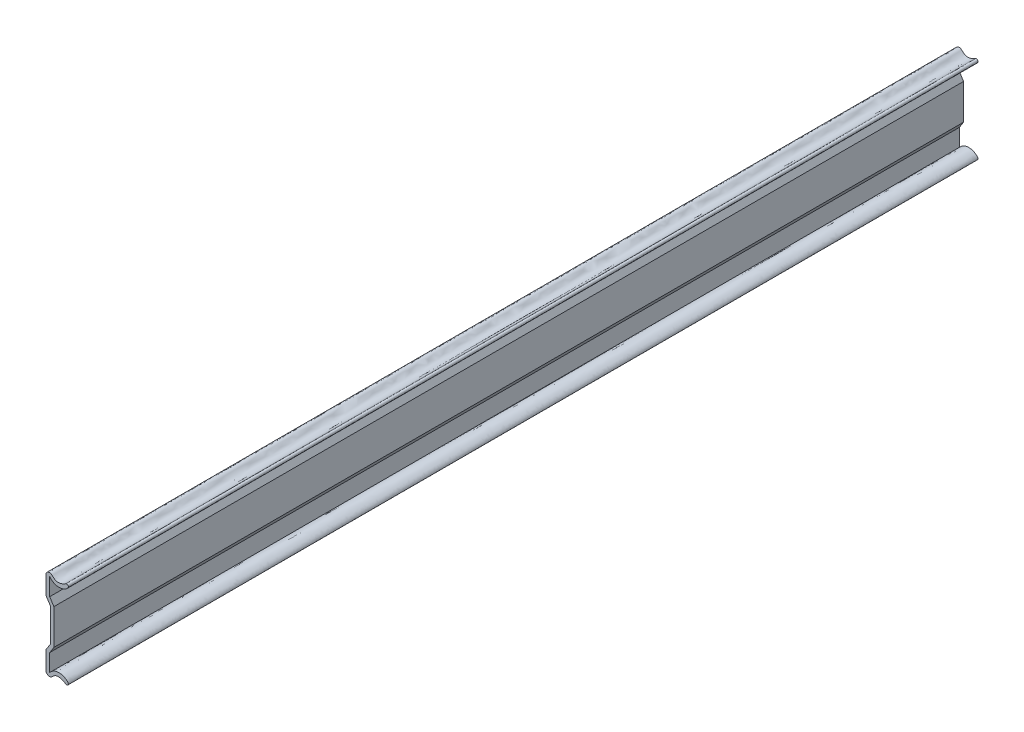
ISO-10303-21;
HEADER;
FILE_DESCRIPTION(('STEP AP214'),'2;1');
FILE_NAME('part.step','',(''),(''),'','','');
FILE_SCHEMA(('AUTOMOTIVE_DESIGN { 1 0 10303 214 1 1 1 1 }'));
ENDSEC;
DATA;
#1=APPLICATION_CONTEXT('core data for automotive mechanical design processes');
#2=APPLICATION_PROTOCOL_DEFINITION('international standard','automotive_design',2000,#1);
#3=PRODUCT_CONTEXT('',#1,'mechanical');
#4=PRODUCT('Part','Part','',(#3));
#5=PRODUCT_RELATED_PRODUCT_CATEGORY('part','',(#4));
#6=PRODUCT_DEFINITION_FORMATION('','',#4);
#7=PRODUCT_DEFINITION_CONTEXT('part definition',#1,'design');
#8=PRODUCT_DEFINITION('design','',#6,#7);
#9=PRODUCT_DEFINITION_SHAPE('','',#8);
#10=(LENGTH_UNIT() NAMED_UNIT(*) SI_UNIT(.MILLI.,.METRE.));
#11=(NAMED_UNIT(*) PLANE_ANGLE_UNIT() SI_UNIT($,.RADIAN.));
#12=(NAMED_UNIT(*) SI_UNIT($,.STERADIAN.) SOLID_ANGLE_UNIT());
#13=UNCERTAINTY_MEASURE_WITH_UNIT(LENGTH_MEASURE(1.E-05),#10,'distance_accuracy_value','');
#14=(GEOMETRIC_REPRESENTATION_CONTEXT(3) GLOBAL_UNCERTAINTY_ASSIGNED_CONTEXT((#13)) GLOBAL_UNIT_ASSIGNED_CONTEXT((#10,
#11,#12)) REPRESENTATION_CONTEXT('',''));
#15=CARTESIAN_POINT('',(0.,0.,0.));
#16=DIRECTION('',(0.,0.,1.));
#17=DIRECTION('',(1.,0.,0.));
#18=AXIS2_PLACEMENT_3D('',#15,#16,#17);
#19=CARTESIAN_POINT('',(9.63346315925961,3919.9605408872,346.));
#20=CARTESIAN_POINT('',(10.4179465492456,3919.37665859407,346.));
#21=CARTESIAN_POINT('',(11.5676687046074,3920.45353455855,346.));
#22=CARTESIAN_POINT('',(9.78538349795511,3921.55514871065,346.));
#23=CARTESIAN_POINT('',(9.77859557084661,3921.55932008849,346.));
#24=CARTESIAN_POINT('',(9.0247952971132,3922.02177137892,346.));
#25=CARTESIAN_POINT('',(8.45326854344088,3922.25080486334,346.));
#26=CARTESIAN_POINT('',(7.53015044228269,3922.35437653868,346.));
#27=CARTESIAN_POINT('',(7.25037518805879,3922.36057796796,346.));
#28=CARTESIAN_POINT('',(6.01569333351951,3922.29069846277,346.));
#29=CARTESIAN_POINT('',(4.86014170825701,3921.98158674794,346.));
#30=CARTESIAN_POINT('',(3.66140402910439,3920.61295155468,346.));
#31=B_SPLINE_CURVE_WITH_KNOTS('',3,(#19,#20,#21,#22,#23,#24,#25,#26,#27,#28,#29,#30),
.UNSPECIFIED.,.F.,.F.,(4,2,2,2,2,4),(0.,0.188476562502227,0.188964843752215,0.500000000001334,
0.625000000001001,1.),.UNSPECIFIED.);
#32=DIRECTION('',(0.,0.,-1.));
#33=VECTOR('',#32,1.);
#34=SURFACE_OF_LINEAR_EXTRUSION('',#31,#33);
#35=CARTESIAN_POINT('',(9.63346315925961,3919.9605408872,0.));
#36=CARTESIAN_POINT('',(10.4179465492456,3919.37665859407,0.));
#37=CARTESIAN_POINT('',(11.5676687046074,3920.45353455855,0.));
#38=CARTESIAN_POINT('',(9.78538349795511,3921.55514871065,0.));
#39=CARTESIAN_POINT('',(9.77859557084661,3921.55932008849,0.));
#40=CARTESIAN_POINT('',(9.0247952971132,3922.02177137892,0.));
#41=CARTESIAN_POINT('',(8.45326854344088,3922.25080486334,0.));
#42=CARTESIAN_POINT('',(7.53015044228269,3922.35437653868,0.));
#43=CARTESIAN_POINT('',(7.25037518805879,3922.36057796796,0.));
#44=CARTESIAN_POINT('',(6.01569333351951,3922.29069846277,0.));
#45=CARTESIAN_POINT('',(4.86014170825701,3921.98158674794,0.));
#46=CARTESIAN_POINT('',(3.66140402910439,3920.61295155468,0.));
#47=B_SPLINE_CURVE_WITH_KNOTS('',3,(#35,#36,#37,#38,#39,#40,#41,#42,#43,#44,#45,#46),
.UNSPECIFIED.,.F.,.F.,(4,2,2,2,2,4),(0.,0.188476562502227,0.188964843752215,0.500000000001334,
0.625000000001001,1.),.UNSPECIFIED.);
#48=CARTESIAN_POINT('',(9.63346315925961,3919.9605408872,0.));
#49=VERTEX_POINT('',#48);
#50=CARTESIAN_POINT('',(3.66140402910439,3920.61295155468,0.));
#51=VERTEX_POINT('',#50);
#52=EDGE_CURVE('E165',#49,#51,#47,.T.);
#53=ORIENTED_EDGE('',*,*,#52,.T.);
#54=DIRECTION('',(0.,0.,-1.));
#55=VECTOR('',#54,1.);
#56=CARTESIAN_POINT('',(3.66140402910439,3920.61295155468,346.));
#57=LINE('',#56,#55);
#58=CARTESIAN_POINT('',(3.66140402910439,3920.61295155468,346.));
#59=VERTEX_POINT('',#58);
#60=EDGE_CURVE('E11',#59,#51,#57,.T.);
#61=ORIENTED_EDGE('',*,*,#60,.F.);
#62=CARTESIAN_POINT('',(9.63346315925961,3919.9605408872,346.));
#63=VERTEX_POINT('',#62);
#64=EDGE_CURVE('E218',#63,#59,#31,.T.);
#65=ORIENTED_EDGE('',*,*,#64,.F.);
#66=DIRECTION('',(0.,0.,-1.));
#67=VECTOR('',#66,1.);
#68=CARTESIAN_POINT('',(9.63346315925961,3919.9605408872,346.));
#69=LINE('',#68,#67);
#70=EDGE_CURVE('E158',#63,#49,#69,.T.);
#71=ORIENTED_EDGE('',*,*,#70,.T.);
#72=EDGE_LOOP('',(#53,#61,#65,#71));
#73=FACE_BOUND('',#72,.T.);
#74=ADVANCED_FACE('F41',(#73),#34,.F.);
#75=CARTESIAN_POINT('',(3.6614040291,3927.2014944656,346.));
#76=DIRECTION('',(-1.,-6.66396982923268E-13,0.));
#77=DIRECTION('',(6.66396982923268E-13,-1.,0.));
#78=AXIS2_PLACEMENT_3D('',#75,#76,#77);
#79=PLANE('',#78);
#80=DIRECTION('',(-6.66396982923268E-13,1.,0.));
#81=VECTOR('',#80,1.);
#82=CARTESIAN_POINT('',(3.6614040291,3927.2014944656,0.));
#83=LINE('',#82,#81);
#84=CARTESIAN_POINT('',(3.6614040291,3927.2014944656,0.));
#85=VERTEX_POINT('',#84);
#86=EDGE_CURVE('E266',#51,#85,#83,.T.);
#87=ORIENTED_EDGE('',*,*,#86,.T.);
#88=DIRECTION('',(0.,0.,-1.));
#89=VECTOR('',#88,1.);
#90=CARTESIAN_POINT('',(3.6614040291,3927.2014944656,346.));
#91=LINE('',#90,#89);
#92=CARTESIAN_POINT('',(3.6614040291,3927.2014944656,346.));
#93=VERTEX_POINT('',#92);
#94=EDGE_CURVE('E50',#93,#85,#91,.T.);
#95=ORIENTED_EDGE('',*,*,#94,.F.);
#96=DIRECTION('',(-6.66396982923268E-13,1.,0.));
#97=VECTOR('',#96,1.);
#98=CARTESIAN_POINT('',(3.6614040291,3927.2014944656,346.));
#99=LINE('',#98,#97);
#100=EDGE_CURVE('E113',#59,#93,#99,.T.);
#101=ORIENTED_EDGE('',*,*,#100,.F.);
#102=ORIENTED_EDGE('',*,*,#60,.T.);
#103=EDGE_LOOP('',(#87,#95,#101,#102));
#104=FACE_BOUND('',#103,.T.);
#105=ADVANCED_FACE('F296',(#104),#79,.F.);
#106=CARTESIAN_POINT('',(5.2393246095,3929.6888032793,346.));
#107=DIRECTION('',(-0.844416011919757,0.535687967769982,0.));
#108=DIRECTION('',(-0.535687967769982,-0.844416011919757,0.));
#109=AXIS2_PLACEMENT_3D('',#106,#107,#108);
#110=PLANE('',#109);
#111=DIRECTION('',(0.535687967769982,0.844416011919757,0.));
#112=VECTOR('',#111,1.);
#113=CARTESIAN_POINT('',(5.2393246095,3929.6888032793,0.));
#114=LINE('',#113,#112);
#115=CARTESIAN_POINT('',(5.2393246095,3929.6888032793,0.));
#116=VERTEX_POINT('',#115);
#117=EDGE_CURVE('E262',#85,#116,#114,.T.);
#118=ORIENTED_EDGE('',*,*,#117,.T.);
#119=DIRECTION('',(0.,0.,-1.));
#120=VECTOR('',#119,1.);
#121=CARTESIAN_POINT('',(5.2393246095,3929.6888032793,346.));
#122=LINE('',#121,#120);
#123=CARTESIAN_POINT('',(5.2393246095,3929.6888032793,346.));
#124=VERTEX_POINT('',#123);
#125=EDGE_CURVE('E254',#124,#116,#122,.T.);
#126=ORIENTED_EDGE('',*,*,#125,.F.);
#127=DIRECTION('',(0.535687967769982,0.844416011919757,0.));
#128=VECTOR('',#127,1.);
#129=CARTESIAN_POINT('',(5.2393246095,3929.6888032793,346.));
#130=LINE('',#129,#128);
#131=EDGE_CURVE('E216',#93,#124,#130,.T.);
#132=ORIENTED_EDGE('',*,*,#131,.F.);
#133=ORIENTED_EDGE('',*,*,#94,.T.);
#134=EDGE_LOOP('',(#118,#126,#132,#133));
#135=FACE_BOUND('',#134,.T.);
#136=ADVANCED_FACE('F260',(#135),#110,.F.);
#137=CARTESIAN_POINT('',(5.2393246095,3943.1194255212,346.));
#138=DIRECTION('',(-1.,0.,0.));
#139=DIRECTION('',(0.,0.,1.));
#140=AXIS2_PLACEMENT_3D('',#137,#138,#139);
#141=PLANE('',#140);
#142=DIRECTION('',(0.,1.,0.));
#143=VECTOR('',#142,1.);
#144=CARTESIAN_POINT('',(5.2393246095,3943.1194255212,0.));
#145=LINE('',#144,#143);
#146=CARTESIAN_POINT('',(5.2393246095,3943.1194255212,0.));
#147=VERTEX_POINT('',#146);
#148=EDGE_CURVE('E268',#116,#147,#145,.T.);
#149=ORIENTED_EDGE('',*,*,#148,.T.);
#150=DIRECTION('',(0.,0.,-1.));
#151=VECTOR('',#150,1.);
#152=CARTESIAN_POINT('',(5.2393246095,3943.1194255212,346.));
#153=LINE('',#152,#151);
#154=CARTESIAN_POINT('',(5.2393246095,3943.1194255212,346.));
#155=VERTEX_POINT('',#154);
#156=EDGE_CURVE('E251',#155,#147,#153,.T.);
#157=ORIENTED_EDGE('',*,*,#156,.F.);
#158=DIRECTION('',(0.,1.,0.));
#159=VECTOR('',#158,1.);
#160=CARTESIAN_POINT('',(5.2393246095,3943.1194255212,346.));
#161=LINE('',#160,#159);
#162=EDGE_CURVE('E214',#124,#155,#161,.T.);
#163=ORIENTED_EDGE('',*,*,#162,.F.);
#164=ORIENTED_EDGE('',*,*,#125,.T.);
#165=EDGE_LOOP('',(#149,#157,#163,#164));
#166=FACE_BOUND('',#165,.T.);
#167=ADVANCED_FACE('F302',(#166),#141,.F.);
#168=CARTESIAN_POINT('',(3.6614040291,3945.6067343349,346.));
#169=DIRECTION('',(-0.844416011919757,-0.535687967769982,0.));
#170=DIRECTION('',(0.535687967769982,-0.844416011919757,0.));
#171=AXIS2_PLACEMENT_3D('',#168,#169,#170);
#172=PLANE('',#171);
#173=DIRECTION('',(-0.535687967769982,0.844416011919757,0.));
#174=VECTOR('',#173,1.);
#175=CARTESIAN_POINT('',(3.6614040291,3945.6067343349,0.));
#176=LINE('',#175,#174);
#177=CARTESIAN_POINT('',(3.6614040291,3945.6067343349,0.));
#178=VERTEX_POINT('',#177);
#179=EDGE_CURVE('E270',#147,#178,#176,.T.);
#180=ORIENTED_EDGE('',*,*,#179,.T.);
#181=DIRECTION('',(0.,0.,-1.));
#182=VECTOR('',#181,1.);
#183=CARTESIAN_POINT('',(3.6614040291,3945.6067343349,346.));
#184=LINE('',#183,#182);
#185=CARTESIAN_POINT('',(3.6614040291,3945.6067343349,346.));
#186=VERTEX_POINT('',#185);
#187=EDGE_CURVE('E248',#186,#178,#184,.T.);
#188=ORIENTED_EDGE('',*,*,#187,.F.);
#189=DIRECTION('',(-0.535687967769982,0.844416011919757,0.));
#190=VECTOR('',#189,1.);
#191=CARTESIAN_POINT('',(3.6614040291,3945.6067343349,346.));
#192=LINE('',#191,#190);
#193=EDGE_CURVE('E212',#155,#186,#192,.T.);
#194=ORIENTED_EDGE('',*,*,#193,.F.);
#195=ORIENTED_EDGE('',*,*,#156,.T.);
#196=EDGE_LOOP('',(#180,#188,#194,#195));
#197=FACE_BOUND('',#196,.T.);
#198=ADVANCED_FACE('F307',(#197),#172,.F.);
#199=CARTESIAN_POINT('',(3.66140402910439,3952.19527724581,346.));
#200=DIRECTION('',(-1.,6.66133688976044E-13,0.));
#201=DIRECTION('',(-6.66133688976044E-13,-1.,0.));
#202=AXIS2_PLACEMENT_3D('',#199,#200,#201);
#203=PLANE('',#202);
#204=DIRECTION('',(6.66133688976044E-13,1.,0.));
#205=VECTOR('',#204,1.);
#206=CARTESIAN_POINT('',(3.66140402910439,3952.19527724581,0.));
#207=LINE('',#206,#205);
#208=CARTESIAN_POINT('',(3.66140402910439,3952.19527724581,0.));
#209=VERTEX_POINT('',#208);
#210=EDGE_CURVE('E274',#178,#209,#207,.T.);
#211=ORIENTED_EDGE('',*,*,#210,.T.);
#212=DIRECTION('',(0.,0.,-1.));
#213=VECTOR('',#212,1.);
#214=CARTESIAN_POINT('',(3.66140402910439,3952.19527724581,346.));
#215=LINE('',#214,#213);
#216=CARTESIAN_POINT('',(3.66140402910439,3952.19527724581,346.));
#217=VERTEX_POINT('',#216);
#218=EDGE_CURVE('E245',#217,#209,#215,.T.);
#219=ORIENTED_EDGE('',*,*,#218,.F.);
#220=DIRECTION('',(6.66133688976044E-13,1.,0.));
#221=VECTOR('',#220,1.);
#222=CARTESIAN_POINT('',(3.66140402910439,3952.19527724581,346.));
#223=LINE('',#222,#221);
#224=EDGE_CURVE('E207',#186,#217,#223,.T.);
#225=ORIENTED_EDGE('',*,*,#224,.F.);
#226=ORIENTED_EDGE('',*,*,#187,.T.);
#227=EDGE_LOOP('',(#211,#219,#225,#226));
#228=FACE_BOUND('',#227,.T.);
#229=ADVANCED_FACE('F310',(#228),#203,.F.);
#230=CARTESIAN_POINT('',(3.66140402910439,3952.19527724581,346.));
#231=CARTESIAN_POINT('',(4.86014170825695,3950.82664205255,346.));
#232=CARTESIAN_POINT('',(6.0156933335194,3950.51753033771,346.));
#233=CARTESIAN_POINT('',(7.25037518805879,3950.44765083253,346.));
#234=CARTESIAN_POINT('',(7.5301504422827,3950.45385226181,346.));
#235=CARTESIAN_POINT('',(8.45326854344119,3950.55742393714,346.));
#236=CARTESIAN_POINT('',(9.02479529713174,3950.78645742166,346.));
#237=CARTESIAN_POINT('',(9.7785955708466,3951.248908712,346.));
#238=CARTESIAN_POINT('',(9.78538349795494,3951.25308008984,346.));
#239=CARTESIAN_POINT('',(11.5676687046076,3952.35469424233,346.));
#240=CARTESIAN_POINT('',(10.4179465492456,3953.43157020642,346.));
#241=CARTESIAN_POINT('',(9.63346315925961,3952.84768791328,346.));
#242=B_SPLINE_CURVE_WITH_KNOTS('',3,(#230,#231,#232,#233,#234,#235,#236,#237,#238,#239,#240,
#241),.UNSPECIFIED.,.F.,.F.,(4,2,2,2,2,4),(0.,0.374999999997284,0.499999999996364,
0.811035156244175,0.811523437494173,1.),.UNSPECIFIED.);
#243=DIRECTION('',(0.,0.,-1.));
#244=VECTOR('',#243,1.);
#245=SURFACE_OF_LINEAR_EXTRUSION('',#242,#244);
#246=CARTESIAN_POINT('',(3.66140402910439,3952.19527724581,0.));
#247=CARTESIAN_POINT('',(4.86014170825695,3950.82664205255,0.));
#248=CARTESIAN_POINT('',(6.0156933335194,3950.51753033771,0.));
#249=CARTESIAN_POINT('',(7.25037518805879,3950.44765083253,0.));
#250=CARTESIAN_POINT('',(7.5301504422827,3950.45385226181,0.));
#251=CARTESIAN_POINT('',(8.45326854344119,3950.55742393714,0.));
#252=CARTESIAN_POINT('',(9.02479529713174,3950.78645742166,0.));
#253=CARTESIAN_POINT('',(9.7785955708466,3951.248908712,0.));
#254=CARTESIAN_POINT('',(9.78538349795494,3951.25308008984,0.));
#255=CARTESIAN_POINT('',(11.5676687046076,3952.35469424233,0.));
#256=CARTESIAN_POINT('',(10.4179465492456,3953.43157020642,0.));
#257=CARTESIAN_POINT('',(9.63346315925961,3952.84768791328,0.));
#258=B_SPLINE_CURVE_WITH_KNOTS('',3,(#246,#247,#248,#249,#250,#251,#252,#253,#254,#255,#256,
#257),.UNSPECIFIED.,.F.,.F.,(4,2,2,2,2,4),(0.,0.374999999997284,0.499999999996364,
0.811035156244175,0.811523437494173,1.),.UNSPECIFIED.);
#259=CARTESIAN_POINT('',(9.63346315925961,3952.84768791328,0.));
#260=VERTEX_POINT('',#259);
#261=EDGE_CURVE('E276',#209,#260,#258,.T.);
#262=ORIENTED_EDGE('',*,*,#261,.T.);
#263=DIRECTION('',(0.,0.,-1.));
#264=VECTOR('',#263,1.);
#265=CARTESIAN_POINT('',(9.63346315925961,3952.84768791328,346.));
#266=LINE('',#265,#264);
#267=CARTESIAN_POINT('',(9.63346315925961,3952.84768791328,346.));
#268=VERTEX_POINT('',#267);
#269=EDGE_CURVE('E242',#268,#260,#266,.T.);
#270=ORIENTED_EDGE('',*,*,#269,.F.);
#271=EDGE_CURVE('E199',#217,#268,#242,.T.);
#272=ORIENTED_EDGE('',*,*,#271,.F.);
#273=ORIENTED_EDGE('',*,*,#218,.T.);
#274=EDGE_LOOP('',(#262,#270,#272,#273));
#275=FACE_BOUND('',#274,.T.);
#276=ADVANCED_FACE('F191',(#275),#245,.F.);
#277=CARTESIAN_POINT('',(9.63346315925961,3952.84768791328,346.));
#278=CARTESIAN_POINT('',(9.27087462847787,3952.57781728821,346.));
#279=CARTESIAN_POINT('',(8.71617917900728,3952.30704735755,346.));
#280=CARTESIAN_POINT('',(7.87069384825325,3952.03851033674,346.));
#281=CARTESIAN_POINT('',(7.58807969295691,3951.97297140786,346.));
#282=CARTESIAN_POINT('',(6.79128584631731,3951.87212702572,346.));
#283=CARTESIAN_POINT('',(6.31651759251921,3951.92429718608,346.));
#284=CARTESIAN_POINT('',(5.72807196973788,3952.15260886724,346.));
#285=CARTESIAN_POINT('',(5.55433883904812,3952.25573905537,346.));
#286=CARTESIAN_POINT('',(5.08318774191439,3952.60869439284,346.));
#287=CARTESIAN_POINT('',(4.58125792989248,3953.18740668712,346.));
#288=CARTESIAN_POINT('',(4.04776020516461,3953.4692331204,346.));
#289=CARTESIAN_POINT('',(3.62159338363642,3953.52389077551,346.));
#290=CARTESIAN_POINT('',(3.47409011930244,3953.51491002304,346.));
#291=CARTESIAN_POINT('',(2.9857451967978,3953.39733177624,346.));
#292=CARTESIAN_POINT('',(2.64491347210658,3953.18919369859,346.));
#293=CARTESIAN_POINT('',(2.43733029743488,3952.95399387343,346.));
#294=CARTESIAN_POINT('',(2.41853461286513,3952.93130014485,346.));
#295=CARTESIAN_POINT('',(2.23236408080449,3952.64476797959,346.));
#296=CARTESIAN_POINT('',(2.24716153988511,3952.00532021402,346.));
#297=CARTESIAN_POINT('',(2.24716153988511,3945.28354046304,346.));
#298=B_SPLINE_CURVE_WITH_KNOTS('',3,(#277,#278,#279,#280,#281,#282,#283,#284,#285,#286,#287,
#288,#289,#290,#291,#292,#293,#294,#295,#296,#297),.UNSPECIFIED.,.F.,.F.,(4,2,2,2,2,1,2,2,2,2,
4),(0.,0.125000000000089,0.187500000000133,0.312500000000222,0.375000000000266,0.50000000000027,
0.625000000000274,0.687500000000263,0.828125000000239,0.843750000000237,1.),.UNSPECIFIED.);
#299=DIRECTION('',(0.,0.,-1.));
#300=VECTOR('',#299,1.);
#301=SURFACE_OF_LINEAR_EXTRUSION('',#298,#300);
#302=CARTESIAN_POINT('',(9.63346315925961,3952.84768791328,0.));
#303=CARTESIAN_POINT('',(9.27087462847787,3952.57781728821,0.));
#304=CARTESIAN_POINT('',(8.71617917900728,3952.30704735755,0.));
#305=CARTESIAN_POINT('',(7.87069384825325,3952.03851033674,0.));
#306=CARTESIAN_POINT('',(7.58807969295691,3951.97297140786,0.));
#307=CARTESIAN_POINT('',(6.79128584631731,3951.87212702572,0.));
#308=CARTESIAN_POINT('',(6.31651759251921,3951.92429718608,0.));
#309=CARTESIAN_POINT('',(5.72807196973788,3952.15260886724,0.));
#310=CARTESIAN_POINT('',(5.55433883904812,3952.25573905537,0.));
#311=CARTESIAN_POINT('',(5.08318774191439,3952.60869439284,0.));
#312=CARTESIAN_POINT('',(4.58125792989248,3953.18740668712,0.));
#313=CARTESIAN_POINT('',(4.04776020516461,3953.4692331204,0.));
#314=CARTESIAN_POINT('',(3.62159338363642,3953.52389077551,0.));
#315=CARTESIAN_POINT('',(3.47409011930244,3953.51491002304,0.));
#316=CARTESIAN_POINT('',(2.9857451967978,3953.39733177624,0.));
#317=CARTESIAN_POINT('',(2.64491347210658,3953.18919369859,0.));
#318=CARTESIAN_POINT('',(2.43733029743488,3952.95399387343,0.));
#319=CARTESIAN_POINT('',(2.41853461286513,3952.93130014485,0.));
#320=CARTESIAN_POINT('',(2.23236408080449,3952.64476797959,0.));
#321=CARTESIAN_POINT('',(2.24716153988511,3952.00532021402,0.));
#322=CARTESIAN_POINT('',(2.24716153988511,3945.28354046304,0.));
#323=B_SPLINE_CURVE_WITH_KNOTS('',3,(#302,#303,#304,#305,#306,#307,#308,#309,#310,#311,#312,
#313,#314,#315,#316,#317,#318,#319,#320,#321,#322),.UNSPECIFIED.,.F.,.F.,(4,2,2,2,2,1,2,2,2,2,
4),(0.,0.125000000000089,0.187500000000133,0.312500000000222,0.375000000000266,0.50000000000027,
0.625000000000274,0.687500000000263,0.828125000000239,0.843750000000237,1.),.UNSPECIFIED.);
#324=CARTESIAN_POINT('',(2.24716153988511,3945.28354046304,0.));
#325=VERTEX_POINT('',#324);
#326=EDGE_CURVE('E280',#260,#325,#323,.T.);
#327=ORIENTED_EDGE('',*,*,#326,.T.);
#328=DIRECTION('',(0.,0.,-1.));
#329=VECTOR('',#328,1.);
#330=CARTESIAN_POINT('',(2.24716153988511,3945.28354046304,346.));
#331=LINE('',#330,#329);
#332=CARTESIAN_POINT('',(2.24716153988511,3945.28354046304,346.));
#333=VERTEX_POINT('',#332);
#334=EDGE_CURVE('E239',#333,#325,#331,.T.);
#335=ORIENTED_EDGE('',*,*,#334,.F.);
#336=EDGE_CURVE('E195',#268,#333,#298,.T.);
#337=ORIENTED_EDGE('',*,*,#336,.F.);
#338=ORIENTED_EDGE('',*,*,#269,.T.);
#339=EDGE_LOOP('',(#327,#335,#337,#338));
#340=FACE_BOUND('',#339,.T.);
#341=ADVANCED_FACE('F186',(#340),#301,.F.);
#342=CARTESIAN_POINT('',(3.9981284313,3942.6139311702,346.));
#343=DIRECTION('',(0.836186418493263,0.548445324100232,0.));
#344=DIRECTION('',(-0.548445324100232,0.836186418493263,0.));
#345=AXIS2_PLACEMENT_3D('',#342,#343,#344);
#346=PLANE('',#345);
#347=DIRECTION('',(0.548445324100232,-0.836186418493263,0.));
#348=VECTOR('',#347,1.);
#349=CARTESIAN_POINT('',(3.9981284313,3942.6139311702,0.));
#350=LINE('',#349,#348);
#351=CARTESIAN_POINT('',(3.9981284313,3942.6139311702,0.));
#352=VERTEX_POINT('',#351);
#353=EDGE_CURVE('E287',#325,#352,#350,.T.);
#354=ORIENTED_EDGE('',*,*,#353,.T.);
#355=DIRECTION('',(0.,0.,-1.));
#356=VECTOR('',#355,1.);
#357=CARTESIAN_POINT('',(3.9981284313,3942.6139311702,346.));
#358=LINE('',#357,#356);
#359=CARTESIAN_POINT('',(3.9981284313,3942.6139311702,346.));
#360=VERTEX_POINT('',#359);
#361=EDGE_CURVE('E153',#360,#352,#358,.T.);
#362=ORIENTED_EDGE('',*,*,#361,.F.);
#363=DIRECTION('',(0.548445324100232,-0.836186418493263,0.));
#364=VECTOR('',#363,1.);
#365=CARTESIAN_POINT('',(3.9981284313,3942.6139311702,346.));
#366=LINE('',#365,#364);
#367=EDGE_CURVE('E144',#333,#360,#366,.T.);
#368=ORIENTED_EDGE('',*,*,#367,.F.);
#369=ORIENTED_EDGE('',*,*,#334,.T.);
#370=EDGE_LOOP('',(#354,#362,#368,#369));
#371=FACE_BOUND('',#370,.T.);
#372=ADVANCED_FACE('F183',(#371),#346,.F.);
#373=CARTESIAN_POINT('',(3.9981284313,3930.1942976303,346.));
#374=DIRECTION('',(1.,0.,0.));
#375=DIRECTION('',(0.,0.,-1.));
#376=AXIS2_PLACEMENT_3D('',#373,#374,#375);
#377=PLANE('',#376);
#378=DIRECTION('',(0.,-1.,0.));
#379=VECTOR('',#378,1.);
#380=CARTESIAN_POINT('',(3.9981284313,3930.1942976303,0.));
#381=LINE('',#380,#379);
#382=CARTESIAN_POINT('',(3.9981284313,3930.1942976303,0.));
#383=VERTEX_POINT('',#382);
#384=EDGE_CURVE('E152',#352,#383,#381,.T.);
#385=ORIENTED_EDGE('',*,*,#384,.T.);
#386=DIRECTION('',(0.,0.,-1.));
#387=VECTOR('',#386,1.);
#388=CARTESIAN_POINT('',(3.9981284313,3930.1942976303,346.));
#389=LINE('',#388,#387);
#390=CARTESIAN_POINT('',(3.9981284313,3930.1942976303,346.));
#391=VERTEX_POINT('',#390);
#392=EDGE_CURVE('E149',#391,#383,#389,.T.);
#393=ORIENTED_EDGE('',*,*,#392,.F.);
#394=DIRECTION('',(0.,-1.,0.));
#395=VECTOR('',#394,1.);
#396=CARTESIAN_POINT('',(3.9981284313,3930.1942976303,346.));
#397=LINE('',#396,#395);
#398=EDGE_CURVE('E138',#360,#391,#397,.T.);
#399=ORIENTED_EDGE('',*,*,#398,.F.);
#400=ORIENTED_EDGE('',*,*,#361,.T.);
#401=EDGE_LOOP('',(#385,#393,#399,#400));
#402=FACE_BOUND('',#401,.T.);
#403=ADVANCED_FACE('F150',(#402),#377,.F.);
#404=CARTESIAN_POINT('',(2.24716153988511,3927.52468833744,346.));
#405=DIRECTION('',(0.836186418495146,-0.548445324097362,0.));
#406=DIRECTION('',(0.548445324097362,0.836186418495146,0.));
#407=AXIS2_PLACEMENT_3D('',#404,#405,#406);
#408=PLANE('',#407);
#409=DIRECTION('',(-0.548445324097362,-0.836186418495146,0.));
#410=VECTOR('',#409,1.);
#411=CARTESIAN_POINT('',(2.24716153988511,3927.52468833744,0.));
#412=LINE('',#411,#410);
#413=CARTESIAN_POINT('',(2.24716153988511,3927.52468833744,0.));
#414=VERTEX_POINT('',#413);
#415=EDGE_CURVE('E99',#383,#414,#412,.T.);
#416=ORIENTED_EDGE('',*,*,#415,.T.);
#417=DIRECTION('',(0.,0.,-1.));
#418=VECTOR('',#417,1.);
#419=CARTESIAN_POINT('',(2.24716153988511,3927.52468833744,346.));
#420=LINE('',#419,#418);
#421=CARTESIAN_POINT('',(2.24716153988511,3927.52468833744,346.));
#422=VERTEX_POINT('',#421);
#423=EDGE_CURVE('E154',#422,#414,#420,.T.);
#424=ORIENTED_EDGE('',*,*,#423,.F.);
#425=DIRECTION('',(-0.548445324097362,-0.836186418495146,0.));
#426=VECTOR('',#425,1.);
#427=CARTESIAN_POINT('',(2.24716153988511,3927.52468833744,346.));
#428=LINE('',#427,#426);
#429=EDGE_CURVE('E142',#391,#422,#428,.T.);
#430=ORIENTED_EDGE('',*,*,#429,.F.);
#431=ORIENTED_EDGE('',*,*,#392,.T.);
#432=EDGE_LOOP('',(#416,#424,#430,#431));
#433=FACE_BOUND('',#432,.T.);
#434=ADVANCED_FACE('F156',(#433),#408,.F.);
#435=CARTESIAN_POINT('',(2.24716153988511,3927.52468833744,346.));
#436=CARTESIAN_POINT('',(2.24716153988511,3920.80290858647,346.));
#437=CARTESIAN_POINT('',(2.23236408080451,3920.1634608209,346.));
#438=CARTESIAN_POINT('',(2.41853461286494,3919.87692865563,346.));
#439=CARTESIAN_POINT('',(2.43733029743468,3919.85423492705,346.));
#440=CARTESIAN_POINT('',(2.64491347210632,3919.61903510189,346.));
#441=CARTESIAN_POINT('',(2.98574519679768,3919.41089702424,346.));
#442=CARTESIAN_POINT('',(3.47409011930251,3919.29331877744,346.));
#443=CARTESIAN_POINT('',(3.62159338363648,3919.28433802497,346.));
#444=CARTESIAN_POINT('',(4.04776020516468,3919.3389956801,346.));
#445=CARTESIAN_POINT('',(4.58125792989245,3919.62082211337,346.));
#446=CARTESIAN_POINT('',(5.08318774191447,3920.19953440764,346.));
#447=CARTESIAN_POINT('',(5.55433883904823,3920.55248974512,346.));
#448=CARTESIAN_POINT('',(5.72807196973801,3920.65561993325,346.));
#449=CARTESIAN_POINT('',(6.31651759251938,3920.88393161441,346.));
#450=CARTESIAN_POINT('',(6.79128584631752,3920.93610177477,346.));
#451=CARTESIAN_POINT('',(7.58807969295716,3920.83525739263,346.));
#452=CARTESIAN_POINT('',(7.87069384825347,3920.76971846375,346.));
#453=CARTESIAN_POINT('',(8.7161791790074,3920.50118144294,346.));
#454=CARTESIAN_POINT('',(9.27087462847791,3920.23041151228,346.));
#455=CARTESIAN_POINT('',(9.63346315925961,3919.9605408872,346.));
#456=B_SPLINE_CURVE_WITH_KNOTS('',3,(#435,#436,#437,#438,#439,#440,#441,#442,#443,#444,#445,
#446,#447,#448,#449,#450,#451,#452,#453,#454,#455),.UNSPECIFIED.,.F.,.F.,(4,2,2,2,2,1,2,2,2,2,
4),(0.,0.156249999999836,0.17187499999984,0.312499999999883,0.374999999999903,0.499999999999917,
0.62499999999993,0.687499999999937,0.812499999999951,0.874999999999958,1.),.UNSPECIFIED.);
#457=DIRECTION('',(0.,0.,-1.));
#458=VECTOR('',#457,1.);
#459=SURFACE_OF_LINEAR_EXTRUSION('',#456,#458);
#460=CARTESIAN_POINT('',(2.24716153988511,3927.52468833744,0.));
#461=CARTESIAN_POINT('',(2.24716153988511,3920.80290858647,0.));
#462=CARTESIAN_POINT('',(2.23236408080451,3920.1634608209,0.));
#463=CARTESIAN_POINT('',(2.41853461286494,3919.87692865563,0.));
#464=CARTESIAN_POINT('',(2.43733029743468,3919.85423492705,0.));
#465=CARTESIAN_POINT('',(2.64491347210632,3919.61903510189,0.));
#466=CARTESIAN_POINT('',(2.98574519679768,3919.41089702424,0.));
#467=CARTESIAN_POINT('',(3.47409011930251,3919.29331877744,0.));
#468=CARTESIAN_POINT('',(3.62159338363648,3919.28433802497,0.));
#469=CARTESIAN_POINT('',(4.04776020516468,3919.3389956801,0.));
#470=CARTESIAN_POINT('',(4.58125792989245,3919.62082211337,0.));
#471=CARTESIAN_POINT('',(5.08318774191447,3920.19953440764,0.));
#472=CARTESIAN_POINT('',(5.55433883904823,3920.55248974512,0.));
#473=CARTESIAN_POINT('',(5.72807196973801,3920.65561993325,0.));
#474=CARTESIAN_POINT('',(6.31651759251938,3920.88393161441,0.));
#475=CARTESIAN_POINT('',(6.79128584631752,3920.93610177477,0.));
#476=CARTESIAN_POINT('',(7.58807969295716,3920.83525739263,0.));
#477=CARTESIAN_POINT('',(7.87069384825347,3920.76971846375,0.));
#478=CARTESIAN_POINT('',(8.7161791790074,3920.50118144294,0.));
#479=CARTESIAN_POINT('',(9.27087462847791,3920.23041151228,0.));
#480=CARTESIAN_POINT('',(9.63346315925961,3919.9605408872,0.));
#481=B_SPLINE_CURVE_WITH_KNOTS('',3,(#460,#461,#462,#463,#464,#465,#466,#467,#468,#469,#470,
#471,#472,#473,#474,#475,#476,#477,#478,#479,#480),.UNSPECIFIED.,.F.,.F.,(4,2,2,2,2,1,2,2,2,2,
4),(0.,0.156249999999836,0.17187499999984,0.312499999999883,0.374999999999903,0.499999999999917,
0.62499999999993,0.687499999999937,0.812499999999951,0.874999999999958,1.),.UNSPECIFIED.);
#482=EDGE_CURVE('E105',#414,#49,#481,.T.);
#483=ORIENTED_EDGE('',*,*,#482,.T.);
#484=ORIENTED_EDGE('',*,*,#70,.F.);
#485=EDGE_CURVE('E58',#422,#63,#456,.T.);
#486=ORIENTED_EDGE('',*,*,#485,.F.);
#487=ORIENTED_EDGE('',*,*,#423,.T.);
#488=EDGE_LOOP('',(#483,#484,#486,#487));
#489=FACE_BOUND('',#488,.T.);
#490=ADVANCED_FACE('F173',(#489),#459,.F.);
#491=CARTESIAN_POINT('',(7.79478452280239,3922.32468521854,346.));
#492=DIRECTION('',(0.,0.,1.));
#493=DIRECTION('',(1.,0.,0.));
#494=AXIS2_PLACEMENT_3D('',#491,#492,#493);
#495=PLANE('',#494);
#496=ORIENTED_EDGE('',*,*,#64,.T.);
#497=ORIENTED_EDGE('',*,*,#100,.T.);
#498=ORIENTED_EDGE('',*,*,#131,.T.);
#499=ORIENTED_EDGE('',*,*,#162,.T.);
#500=ORIENTED_EDGE('',*,*,#193,.T.);
#501=ORIENTED_EDGE('',*,*,#224,.T.);
#502=ORIENTED_EDGE('',*,*,#271,.T.);
#503=ORIENTED_EDGE('',*,*,#336,.T.);
#504=ORIENTED_EDGE('',*,*,#367,.T.);
#505=ORIENTED_EDGE('',*,*,#398,.T.);
#506=ORIENTED_EDGE('',*,*,#429,.T.);
#507=ORIENTED_EDGE('',*,*,#485,.T.);
#508=EDGE_LOOP('',(#496,#497,#498,#499,#500,#501,#502,#503,#504,#505,#506,#507));
#509=FACE_BOUND('',#508,.T.);
#510=ADVANCED_FACE('F140',(#509),#495,.T.);
#511=CARTESIAN_POINT('',(7.79478452280239,3922.32468521854,0.));
#512=DIRECTION('',(0.,0.,1.));
#513=DIRECTION('',(1.,0.,0.));
#514=AXIS2_PLACEMENT_3D('',#511,#512,#513);
#515=PLANE('',#514);
#516=ORIENTED_EDGE('',*,*,#52,.F.);
#517=ORIENTED_EDGE('',*,*,#482,.F.);
#518=ORIENTED_EDGE('',*,*,#415,.F.);
#519=ORIENTED_EDGE('',*,*,#384,.F.);
#520=ORIENTED_EDGE('',*,*,#353,.F.);
#521=ORIENTED_EDGE('',*,*,#326,.F.);
#522=ORIENTED_EDGE('',*,*,#261,.F.);
#523=ORIENTED_EDGE('',*,*,#210,.F.);
#524=ORIENTED_EDGE('',*,*,#179,.F.);
#525=ORIENTED_EDGE('',*,*,#148,.F.);
#526=ORIENTED_EDGE('',*,*,#117,.F.);
#527=ORIENTED_EDGE('',*,*,#86,.F.);
#528=EDGE_LOOP('',(#516,#517,#518,#519,#520,#521,#522,#523,#524,#525,#526,#527));
#529=FACE_BOUND('',#528,.T.);
#530=ADVANCED_FACE('F177',(#529),#515,.F.);
#531=CLOSED_SHELL('',(#74,#105,#136,#167,#198,#229,#276,#341,#372,#403,#434,#490,#510,#530));
#532=MANIFOLD_SOLID_BREP('B2',#531);
#533=ADVANCED_BREP_SHAPE_REPRESENTATION('',(#18,#532),#14);
#534=SHAPE_DEFINITION_REPRESENTATION(#9,#533);
ENDSEC;
END-ISO-10303-21;
